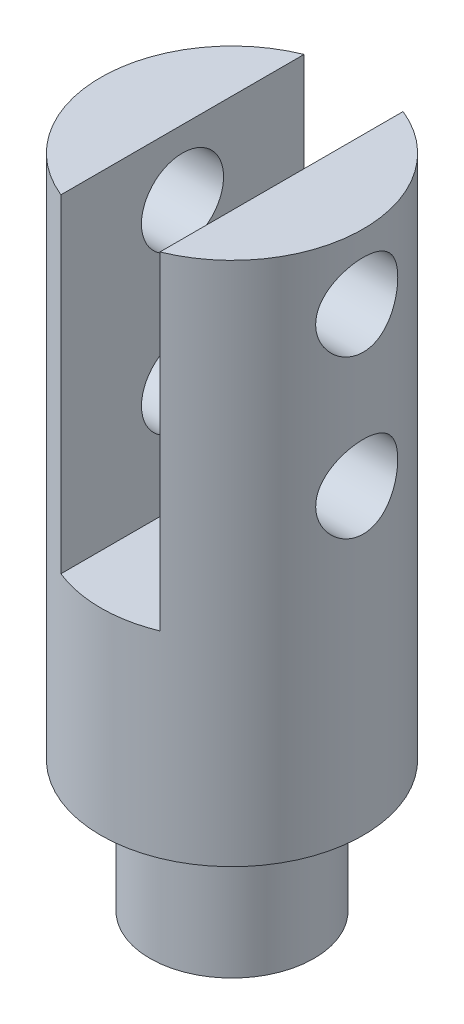
ISO-10303-21;
HEADER;
FILE_DESCRIPTION(('STEP AP214'),'2;1');
FILE_NAME('part.step','',(''),(''),'','','');
FILE_SCHEMA(('AUTOMOTIVE_DESIGN { 1 0 10303 214 1 1 1 1 }'));
ENDSEC;
DATA;
#1=APPLICATION_CONTEXT('core data for automotive mechanical design processes');
#2=APPLICATION_PROTOCOL_DEFINITION('international standard','automotive_design',2000,#1);
#3=PRODUCT_CONTEXT('',#1,'mechanical');
#4=PRODUCT('Part','Part','',(#3));
#5=PRODUCT_RELATED_PRODUCT_CATEGORY('part','',(#4));
#6=PRODUCT_DEFINITION_FORMATION('','',#4);
#7=PRODUCT_DEFINITION_CONTEXT('part definition',#1,'design');
#8=PRODUCT_DEFINITION('design','',#6,#7);
#9=PRODUCT_DEFINITION_SHAPE('','',#8);
#10=(LENGTH_UNIT() NAMED_UNIT(*) SI_UNIT(.MILLI.,.METRE.));
#11=(NAMED_UNIT(*) PLANE_ANGLE_UNIT() SI_UNIT($,.RADIAN.));
#12=(NAMED_UNIT(*) SI_UNIT($,.STERADIAN.) SOLID_ANGLE_UNIT());
#13=UNCERTAINTY_MEASURE_WITH_UNIT(LENGTH_MEASURE(1.E-05),#10,'distance_accuracy_value','');
#14=(GEOMETRIC_REPRESENTATION_CONTEXT(3) GLOBAL_UNCERTAINTY_ASSIGNED_CONTEXT((#13)) GLOBAL_UNIT_ASSIGNED_CONTEXT((#10,
#11,#12)) REPRESENTATION_CONTEXT('',''));
#15=CARTESIAN_POINT('',(0.,0.,0.));
#16=DIRECTION('',(0.,0.,1.));
#17=DIRECTION('',(1.,0.,0.));
#18=AXIS2_PLACEMENT_3D('',#15,#16,#17);
#19=CARTESIAN_POINT('',(0.,0.,0.));
#20=DIRECTION('',(0.,1.,0.));
#21=DIRECTION('',(0.,0.,1.));
#22=AXIS2_PLACEMENT_3D('',#19,#20,#21);
#23=PLANE('',#22);
#24=DIRECTION('',(0.,0.,-1.));
#25=VECTOR('',#24,1.);
#26=CARTESIAN_POINT('',(4.7879,0.,26.2227099301437));
#27=LINE('',#26,#25);
#28=CARTESIAN_POINT('',(4.7879,0.,11.7629083814336));
#29=VERTEX_POINT('',#28);
#30=CARTESIAN_POINT('',(4.7879,0.,-11.7629083814336));
#31=VERTEX_POINT('',#30);
#32=EDGE_CURVE('E77',#29,#31,#27,.T.);
#33=ORIENTED_EDGE('',*,*,#32,.F.);
#34=CARTESIAN_POINT('',(0.,0.,0.));
#35=DIRECTION('',(0.,1.,0.));
#36=DIRECTION('',(0.,0.,1.));
#37=AXIS2_PLACEMENT_3D('',#34,#35,#36);
#38=CIRCLE('',#37,12.7);
#39=EDGE_CURVE('E84',#29,#31,#38,.T.);
#40=ORIENTED_EDGE('',*,*,#39,.T.);
#41=EDGE_LOOP('',(#33,#40));
#42=FACE_BOUND('',#41,.T.);
#43=ADVANCED_FACE('F34',(#42),#23,.T.);
#44=DIRECTION('',(0.,0.,1.));
#45=VECTOR('',#44,1.);
#46=CARTESIAN_POINT('',(-4.7879,0.,26.2227099301437));
#47=LINE('',#46,#45);
#48=CARTESIAN_POINT('',(-4.7879,0.,-11.7629083814336));
#49=VERTEX_POINT('',#48);
#50=CARTESIAN_POINT('',(-4.7879,0.,11.7629083814336));
#51=VERTEX_POINT('',#50);
#52=EDGE_CURVE('E85',#49,#51,#47,.T.);
#53=ORIENTED_EDGE('',*,*,#52,.F.);
#54=EDGE_CURVE('E93',#49,#51,#38,.T.);
#55=ORIENTED_EDGE('',*,*,#54,.T.);
#56=EDGE_LOOP('',(#53,#55));
#57=FACE_BOUND('',#56,.T.);
#58=ADVANCED_FACE('F36',(#57),#23,.T.);
#59=CARTESIAN_POINT('',(0.,54.1051229508197,0.));
#60=DIRECTION('',(0.,1.,0.));
#61=DIRECTION('',(0.,0.,1.));
#62=AXIS2_PLACEMENT_3D('',#59,#60,#61);
#63=CYLINDRICAL_SURFACE('',#62,12.7);
#64=CARTESIAN_POINT('',(-12.7,-2.37744,0.));
#65=CARTESIAN_POINT('',(-12.6999989364852,-2.37744138791249,-0.217492557763878));
#66=CARTESIAN_POINT('',(-12.6943603110892,-2.39536000112773,-0.43499970457634));
#67=CARTESIAN_POINT('',(-12.6724191916379,-2.46637270695974,-0.863652552627288));
#68=CARTESIAN_POINT('',(-12.6561143024,-2.51947470027949,-1.07479681389357));
#69=CARTESIAN_POINT('',(-12.6146217111831,-2.6588878067983,-1.48448068440005));
#70=CARTESIAN_POINT('',(-12.5894477791866,-2.74514745856465,-1.68303927334254));
#71=CARTESIAN_POINT('',(-12.5328159290258,-2.94820815004892,-2.06287399242892));
#72=CARTESIAN_POINT('',(-12.5013570171812,-3.06501402014844,-2.2441473830109));
#73=CARTESIAN_POINT('',(-12.434405504797,-3.32965530098341,-2.58987502339287));
#74=CARTESIAN_POINT('',(-12.3988248999794,-3.47826499988978,-2.75371947787847));
#75=CARTESIAN_POINT('',(-12.3281495374864,-3.80064685931324,-3.05461377606018));
#76=CARTESIAN_POINT('',(-12.2930548716153,-3.97442370525733,-3.19165861921905));
#77=CARTESIAN_POINT('',(-12.2263802746652,-4.34748898232327,-3.43837247280718));
#78=CARTESIAN_POINT('',(-12.1949089417569,-4.54730273264139,-3.54727926216575));
#79=CARTESIAN_POINT('',(-12.1403681406173,-4.96355279542945,-3.72969053094531));
#80=CARTESIAN_POINT('',(-12.1172964547123,-5.17998470207569,-3.80320435646769));
#81=CARTESIAN_POINT('',(-12.0830878271828,-5.61644554014773,-3.91051080755888));
#82=CARTESIAN_POINT('',(-12.0716118578883,-5.83616901477066,-3.94543476323751));
#83=CARTESIAN_POINT('',(-12.0608874846081,-6.27863327561589,-3.97810456397336));
#84=CARTESIAN_POINT('',(-12.0616358227427,-6.50137324210696,-3.97586031466403));
#85=CARTESIAN_POINT('',(-12.0749762843099,-6.93418525877417,-3.93514217597677));
#86=CARTESIAN_POINT('',(-12.087098059951,-7.1444095994836,-3.89810699023441));
#87=CARTESIAN_POINT('',(-12.1210554098322,-7.55549695839661,-3.79119112966301));
#88=CARTESIAN_POINT('',(-12.142892018231,-7.75635897745129,-3.72130695796479));
#89=CARTESIAN_POINT('',(-12.1941787219778,-8.14644504195209,-3.54966190182948));
#90=CARTESIAN_POINT('',(-12.2237355296374,-8.33545582985697,-3.44744961529387));
#91=CARTESIAN_POINT('',(-12.2870834938587,-8.69411470789891,-3.21436326003549));
#92=CARTESIAN_POINT('',(-12.3208757511563,-8.86375774263885,-3.08348173393025));
#93=CARTESIAN_POINT('',(-12.3907734671559,-9.1869984375376,-2.78971448911799));
#94=CARTESIAN_POINT('',(-12.4269141304001,-9.33951122177774,-2.62564123753074));
#95=CARTESIAN_POINT('',(-12.496077188252,-9.61512130845667,-2.27379788611728));
#96=CARTESIAN_POINT('',(-12.5290993508445,-9.73821642327437,-2.08602602554894));
#97=CARTESIAN_POINT('',(-12.5886526113865,-9.95223396566114,-1.69002189927923));
#98=CARTESIAN_POINT('',(-12.615130911478,-10.0428971859756,-1.48164107002917));
#99=CARTESIAN_POINT('',(-12.6582318933316,-10.187560916962,-1.05156492180258));
#100=CARTESIAN_POINT('',(-12.6748575734968,-10.241572582362,-0.829873676166752));
#101=CARTESIAN_POINT('',(-12.6958973744177,-10.3095509256056,-0.388678056186915));
#102=CARTESIAN_POINT('',(-12.7007591131408,-10.3249862243419,-0.169420979767007));
#103=CARTESIAN_POINT('',(-12.699047355392,-10.3195150470694,0.268574231623304));
#104=CARTESIAN_POINT('',(-12.6924755329623,-10.2986138912544,0.487312437868517));
#105=CARTESIAN_POINT('',(-12.6689292134884,-10.2222418730986,0.912393047829627));
#106=CARTESIAN_POINT('',(-12.6522179733833,-10.1676452722643,1.11890850891783));
#107=CARTESIAN_POINT('',(-12.6103486256779,-10.0264993070627,1.51978981464501));
#108=CARTESIAN_POINT('',(-12.5851894743012,-9.93994599417147,1.71415415443784));
#109=CARTESIAN_POINT('',(-12.5282468497323,-9.73498197711441,2.09049282048022));
#110=CARTESIAN_POINT('',(-12.4963166747063,-9.61584524162483,2.27204892256562));
#111=CARTESIAN_POINT('',(-12.4294826490376,-9.34996705404039,2.61308445363422));
#112=CARTESIAN_POINT('',(-12.3945779918333,-9.20321810149365,2.77255786369947));
#113=CARTESIAN_POINT('',(-12.3239844248312,-8.87937364357529,3.07147417537215));
#114=CARTESIAN_POINT('',(-12.2883194045385,-8.70130456189332,3.20987033295593));
#115=CARTESIAN_POINT('',(-12.2216926111029,-8.32369495443146,3.45491105869465));
#116=CARTESIAN_POINT('',(-12.1907307645994,-8.12415476364334,3.56155612213168));
#117=CARTESIAN_POINT('',(-12.1373588401913,-7.70967306391737,3.7394065462174));
#118=CARTESIAN_POINT('',(-12.1149159152886,-7.49479458581322,3.81074835817004));
#119=CARTESIAN_POINT('',(-12.0813163108925,-7.05522861295752,3.9159809635055));
#120=CARTESIAN_POINT('',(-12.070155326175,-6.83054489408704,3.9498860433205));
#121=CARTESIAN_POINT('',(-12.0608324695137,-6.38869066565558,3.97825560084036));
#122=CARTESIAN_POINT('',(-12.062104519437,-6.1716410092991,3.97443753066441));
#123=CARTESIAN_POINT('',(-12.0761289096867,-5.74143784306023,3.93161628411661));
#124=CARTESIAN_POINT('',(-12.0888807125414,-5.52828415124905,3.89261475500183));
#125=CARTESIAN_POINT('',(-12.1240318794813,-5.11500121092369,3.78168430417645));
#126=CARTESIAN_POINT('',(-12.1462866983272,-4.91472658333173,3.71024774286122));
#127=CARTESIAN_POINT('',(-12.1978991973409,-4.52884612131617,3.53686292923591));
#128=CARTESIAN_POINT('',(-12.2272583240984,-4.34324328460893,3.43490846182106));
#129=CARTESIAN_POINT('',(-12.2912067958949,-3.98410156989901,3.19870947726234));
#130=CARTESIAN_POINT('',(-12.3259560124056,-3.81132045239107,3.06335617834633));
#131=CARTESIAN_POINT('',(-12.3960349657771,-3.49036779598578,2.76615169588709));
#132=CARTESIAN_POINT('',(-12.43136485575,-3.34220286611897,2.60429341929131));
#133=CARTESIAN_POINT('',(-12.5000119585414,-3.06983228211151,2.25229799874578));
#134=CARTESIAN_POINT('',(-12.5332254124341,-2.94656982318234,2.06140852836853));
#135=CARTESIAN_POINT('',(-12.5925940830216,-2.73404722162869,1.6605794856469));
#136=CARTESIAN_POINT('',(-12.6187520601081,-2.64477377546746,1.45064740663411));
#137=CARTESIAN_POINT('',(-12.6592504823893,-2.50920890104685,1.03589988887822));
#138=CARTESIAN_POINT('',(-12.674398700637,-2.45993813677705,0.832134597580989));
#139=CARTESIAN_POINT('',(-12.6947729630997,-2.39405633740357,0.41891660491495));
#140=CARTESIAN_POINT('',(-12.7000010242612,-2.37743866331433,0.209465068448066));
#141=CARTESIAN_POINT('',(-12.7,-2.37744,0.));
#142=B_SPLINE_CURVE_WITH_KNOTS('',3,(#64,#65,#66,#67,#68,#69,#70,#71,#72,#73,#74,#75,#76,#77,
#78,#79,#80,#81,#82,#83,#84,#85,#86,#87,#88,#89,#90,#91,#92,#93,#94,#95,#96,#97,#98,#99,#100,
#101,#102,#103,#104,#105,#106,#107,#108,#109,#110,#111,#112,#113,#114,#115,#116,#117,#118,#119,
#120,#121,#122,#123,#124,#125,#126,#127,#128,#129,#130,#131,#132,#133,#134,#135,#136,#137,#138,
#139,#140,#141),.UNSPECIFIED.,.T.,.F.,(4,2,2,2,2,2,2,2,2,2,2,2,2,2,2,2,2,2,2,2,2,2,2,2,2,2,2,2,
2,2,2,2,2,2,2,2,2,2,4),(0.,0.651707735300668,1.30356186628947,1.9544083633484,2.60535784336777,
3.2744551875713,3.94367725971725,4.6294766958225,5.31509493570358,5.98003087291569,
6.64478960206365,7.28321492869985,7.92170823294808,8.56954277091646,9.21754602277983,
9.89510763680892,10.5727196214891,11.2556323060653,11.9383370560521,12.594625460782,
13.2508177832876,13.8906613923976,14.5305840861059,15.1861264828991,15.8418472058662,
16.5236038200059,17.2053497989362,17.8844397552653,18.5632704707704,19.2113432651236,
19.8593857188815,20.4979038526516,21.1365521120022,21.8002269495809,22.4640796856973,
23.1496659626656,23.8349836198352,24.4627649579607,25.0904186431553),.UNSPECIFIED.);
#143=CARTESIAN_POINT('',(-12.7,-2.37744,0.));
#144=VERTEX_POINT('',#143);
#145=EDGE_CURVE('E86',#144,#144,#142,.T.);
#146=ORIENTED_EDGE('',*,*,#145,.F.);
#147=EDGE_LOOP('',(#146));
#148=FACE_BOUND('',#147,.T.);
#149=CARTESIAN_POINT('',(12.0627014821059,-6.35,-3.97256));
#150=CARTESIAN_POINT('',(12.0627027961794,-6.1328014116811,-3.97255856310129));
#151=CARTESIAN_POINT('',(12.0686319145908,-5.91558819013561,-3.9546866204507));
#152=CARTESIAN_POINT('',(12.0916026560791,-5.48754390676897,-3.88387609666546));
#153=CARTESIAN_POINT('',(12.1086472651352,-5.27671457579608,-3.83092809290926));
#154=CARTESIAN_POINT('',(12.151733687867,-4.86770022532404,-3.69196471501516));
#155=CARTESIAN_POINT('',(12.177759548921,-4.66949351983241,-3.60600794117009));
#156=CARTESIAN_POINT('',(12.2358538393342,-4.29025909529024,-3.40366261620942));
#157=CARTESIAN_POINT('',(12.2679233397837,-4.10923442990888,-3.28726866941442));
#158=CARTESIAN_POINT('',(12.3357294758176,-3.76327207579501,-3.0230627709514));
#159=CARTESIAN_POINT('',(12.3715493244807,-3.59901278367133,-2.87438364518377));
#160=CARTESIAN_POINT('',(12.4421121709539,-3.29730488218388,-2.55168336334861));
#161=CARTESIAN_POINT('',(12.4768550175283,-3.15986002396383,-2.37765866755945));
#162=CARTESIAN_POINT('',(12.5423012936835,-2.9126877385371,-2.00433093566138));
#163=CARTESIAN_POINT('',(12.5728953234145,-2.80365912650236,-1.80454436598342));
#164=CARTESIAN_POINT('',(12.6256249951138,-2.62101558695137,-1.38834990171707));
#165=CARTESIAN_POINT('',(12.6477626289638,-2.5473923187407,-1.17194593575396));
#166=CARTESIAN_POINT('',(12.6804961935347,-2.43991497719421,-0.735762867909985));
#167=CARTESIAN_POINT('',(12.6914279026824,-2.40490137292181,-0.516295138671484));
#168=CARTESIAN_POINT('',(12.7017039066272,-2.37196320664494,-0.0743459833627602));
#169=CARTESIAN_POINT('',(12.7010508403752,-2.37403019787731,0.148134744824027));
#170=CARTESIAN_POINT('',(12.6884645894265,-2.41443214938406,0.581632908143987));
#171=CARTESIAN_POINT('',(12.6769223774942,-2.45151008863624,0.792780663294784));
#172=CARTESIAN_POINT('',(12.6443357310436,-2.55881865657165,1.20569070482151));
#173=CARTESIAN_POINT('',(12.6232906764193,-2.62905144878121,1.40745237776282));
#174=CARTESIAN_POINT('',(12.5735385181353,-2.80148270802431,1.79876115661538));
#175=CARTESIAN_POINT('',(12.5447406908756,-2.90406230656547,1.98812830542386));
#176=CARTESIAN_POINT('',(12.4825166385278,-3.137969442559,2.34735212904115));
#177=CARTESIAN_POINT('',(12.4490892421003,-3.26930426034461,2.51720384623838));
#178=CARTESIAN_POINT('',(12.3795164475622,-3.56344567216257,2.8400704159051));
#179=CARTESIAN_POINT('',(12.3433158389733,-3.72733730226057,2.99208624562731));
#180=CARTESIAN_POINT('',(12.2734806830765,-4.07862522252041,3.26677379487549));
#181=CARTESIAN_POINT('',(12.239846439547,-4.26602428831702,3.38944204421229));
#182=CARTESIAN_POINT('',(12.1786733891543,-4.66183500541037,3.60311772524955));
#183=CARTESIAN_POINT('',(12.1512072163646,-4.87045884890678,3.69375443428513));
#184=CARTESIAN_POINT('',(12.1063320884953,-5.30107422021659,3.83829620438531));
#185=CARTESIAN_POINT('',(12.0889195120697,-5.52306090282515,3.89221449283095));
#186=CARTESIAN_POINT('',(12.0669271388999,-5.96452772533215,3.95986001038957));
#187=CARTESIAN_POINT('',(12.061859113871,-6.18374923098028,3.97511732261505));
#188=CARTESIAN_POINT('',(12.0637740199026,-6.62163542974182,3.96930373197379));
#189=CARTESIAN_POINT('',(12.0707550844942,-6.84030020384132,3.9482384556727));
#190=CARTESIAN_POINT('',(12.0954994954556,-7.26427318135323,3.87174517337134));
#191=CARTESIAN_POINT('',(12.1129443996281,-7.46978482128579,3.81733103647696));
#192=CARTESIAN_POINT('',(12.1563133173933,-7.86873785457212,3.67687538646103));
#193=CARTESIAN_POINT('',(12.1822387155875,-8.06217727076107,3.59082870844302));
#194=CARTESIAN_POINT('',(12.2405718748575,-8.43764368473302,3.38673027946662));
#195=CARTESIAN_POINT('',(12.2731444369954,-8.61918330808252,3.26783025311601));
#196=CARTESIAN_POINT('',(12.3407609000887,-8.96029082174931,3.00239016107204));
#197=CARTESIAN_POINT('',(12.3758054427688,-9.11985297475027,2.85584290151663));
#198=CARTESIAN_POINT('',(12.4461785640103,-9.41931305155079,2.53202783311835));
#199=CARTESIAN_POINT('',(12.4814584813061,-9.55811893459465,2.35373685340041));
#200=CARTESIAN_POINT('',(12.5468728034526,-9.8038851711639,1.97553942683843));
#201=CARTESIAN_POINT('',(12.5770074433862,-9.91084697978206,1.77563396822211));
#202=CARTESIAN_POINT('',(12.628564136677,-10.088863319273,1.36111026800587));
#203=CARTESIAN_POINT('',(12.6500489695962,-10.1601775265454,1.14661175504248));
#204=CARTESIAN_POINT('',(12.682161350964,-10.2654817662206,0.707874785633673));
#205=CARTESIAN_POINT('',(12.6927923041024,-10.2994835032037,0.483639406512681));
#206=CARTESIAN_POINT('',(12.7017730874969,-10.328245358304,0.0418454583490813));
#207=CARTESIAN_POINT('',(12.7006165610339,-10.3245827474622,-0.175601606140479));
#208=CARTESIAN_POINT('',(12.6873351980789,-10.2819352178962,-0.606642268059739));
#209=CARTESIAN_POINT('',(12.6752110790507,-10.2429526096893,-0.820236116621895));
#210=CARTESIAN_POINT('',(12.6415133332292,-10.1317765691931,-1.2348723203477));
#211=CARTESIAN_POINT('',(12.6200602203846,-10.0600061183378,-1.43603856480608));
#212=CARTESIAN_POINT('',(12.5699169003506,-9.88567391483367,-1.82357071830948));
#213=CARTESIAN_POINT('',(12.5412254508483,-9.78310687600334,-2.00993407951481));
#214=CARTESIAN_POINT('',(12.4783861846941,-9.54606433729466,-2.36945773200867));
#215=CARTESIAN_POINT('',(12.4440861461251,-9.4106234222484,-2.54195462168637));
#216=CARTESIAN_POINT('',(12.3743360478658,-9.11337966785593,-2.8622955421123));
#217=CARTESIAN_POINT('',(12.3388856463222,-8.95156893365666,-3.01013216292368));
#218=CARTESIAN_POINT('',(12.2694505882544,-8.59973731966918,-3.28191133410888));
#219=CARTESIAN_POINT('',(12.2355537207499,-8.4089579821783,-3.40489719600126));
#220=CARTESIAN_POINT('',(12.1745663544634,-8.00841930528113,-3.61692863151599));
#221=CARTESIAN_POINT('',(12.1474731173528,-7.79866764824759,-3.70598786742965));
#222=CARTESIAN_POINT('',(12.1053693118272,-7.38440106970992,-3.84117521600551));
#223=CARTESIAN_POINT('',(12.0895300101337,-7.18094616382303,-3.89029956312878));
#224=CARTESIAN_POINT('',(12.0681967431713,-6.76833107883764,-3.95598861642747));
#225=CARTESIAN_POINT('',(12.0627002165921,-6.55917232527348,-3.97256138380017));
#226=CARTESIAN_POINT('',(12.0627014821059,-6.35,-3.97256));
#227=B_SPLINE_CURVE_WITH_KNOTS('',3,(#149,#150,#151,#152,#153,#154,#155,#156,#157,#158,#159,
#160,#161,#162,#163,#164,#165,#166,#167,#168,#169,#170,#171,#172,#173,#174,#175,#176,#177,#178,
#179,#180,#181,#182,#183,#184,#185,#186,#187,#188,#189,#190,#191,#192,#193,#194,#195,#196,#197,
#198,#199,#200,#201,#202,#203,#204,#205,#206,#207,#208,#209,#210,#211,#212,#213,#214,#215,#216,
#217,#218,#219,#220,#221,#222,#223,#224,#225,#226),.UNSPECIFIED.,.T.,.F.,(4,2,2,2,2,2,2,2,2,2,2,
2,2,2,2,2,2,2,2,2,2,2,2,2,2,2,2,2,2,2,2,2,2,2,2,2,2,2,4),(0.,0.650823065553643,1.30182103522614,
1.95166859496758,2.60163143311805,3.2718794320224,3.94222112660542,4.62775599462304,
5.31312928699614,5.9773058803367,6.64133117969034,7.28238713481386,7.92348492795103,
8.57243810432638,9.22155577501555,9.89777455807484,10.5740732607921,11.2579609346512,
11.9416021154774,12.5977316209682,13.253759497576,13.8907693124233,14.5278831831561,
15.1832964780732,15.8388805485644,16.5216946490341,17.2044775439993,17.8822114305849,
18.5597326574265,19.2090008617428,19.8582265961503,20.4993036791531,21.1404908649057,
21.8034551456627,22.4666182769928,23.1518073531519,23.8367202104603,24.4636483153288,
25.090421145747),.UNSPECIFIED.);
#228=CARTESIAN_POINT('',(12.0627014821059,-6.35,-3.97256));
#229=VERTEX_POINT('',#228);
#230=EDGE_CURVE('E194',#229,#229,#227,.T.);
#231=ORIENTED_EDGE('',*,*,#230,.F.);
#232=EDGE_LOOP('',(#231));
#233=FACE_BOUND('',#232,.T.);
#234=CARTESIAN_POINT('',(-12.7,-17.62125,0.));
#235=CARTESIAN_POINT('',(-12.6999989166262,-17.6212514179156,-0.217294412929185));
#236=CARTESIAN_POINT('',(-12.6943705657687,-17.6391545455486,-0.434603691696578));
#237=CARTESIAN_POINT('',(-12.6724693873196,-17.7101063168871,-0.862867240443323));
#238=CARTESIAN_POINT('',(-12.6561941503455,-17.7631629158318,-1.07382006065476));
#239=CARTESIAN_POINT('',(-12.6147771484086,-17.9024577535465,-1.48313312609131));
#240=CARTESIAN_POINT('',(-12.589649112594,-17.9886446317732,-1.68151231192993));
#241=CARTESIAN_POINT('',(-12.5331210208647,-18.1915349836287,-2.06100299745001));
#242=CARTESIAN_POINT('',(-12.5017199768221,-18.3082432659034,-2.24211177003752));
#243=CARTESIAN_POINT('',(-12.4348942862538,-18.5726577746551,-2.58751493847349));
#244=CARTESIAN_POINT('',(-12.3993819806814,-18.7211363100689,-2.75120108939738));
#245=CARTESIAN_POINT('',(-12.3288439723815,-19.043232145913,-3.05180168796747));
#246=CARTESIAN_POINT('',(-12.2938183613714,-19.2168541160451,-3.18871115145341));
#247=CARTESIAN_POINT('',(-12.2272788441653,-19.5895739900908,-3.4351701833388));
#248=CARTESIAN_POINT('',(-12.1958731285757,-19.7891954911493,-3.5439598967664));
#249=CARTESIAN_POINT('',(-12.141447707132,-20.2050406000671,-3.72617177918452));
#250=CARTESIAN_POINT('',(-12.1184257926095,-20.4212598171443,-3.79960326475997));
#251=CARTESIAN_POINT('',(-12.0842915217349,-20.8572991459117,-3.90678860277786));
#252=CARTESIAN_POINT('',(-12.0728413904273,-21.0768147285585,-3.94167074274712));
#253=CARTESIAN_POINT('',(-12.0621442508097,-21.5188581525402,-3.97429212242695));
#254=CARTESIAN_POINT('',(-12.062893998283,-21.7413851773397,-3.97204123662538));
#255=CARTESIAN_POINT('',(-12.0762137528427,-22.1738014113807,-3.93134293525445));
#256=CARTESIAN_POINT('',(-12.0883153493259,-22.383842474694,-3.89432983731616));
#257=CARTESIAN_POINT('',(-12.1222143133603,-22.7945700970855,-3.78748332400532));
#258=CARTESIAN_POINT('',(-12.144012711345,-22.9952556594939,-3.71764642055649));
#259=CARTESIAN_POINT('',(-12.1952081477563,-23.384992423548,-3.5461217711417));
#260=CARTESIAN_POINT('',(-12.2247115380623,-23.5738308389402,-3.44398363977409));
#261=CARTESIAN_POINT('',(-12.287943946336,-23.9321586630231,-3.21106865842369));
#262=CARTESIAN_POINT('',(-12.3216740610048,-24.1016430280574,-3.08028436905926));
#263=CARTESIAN_POINT('',(-12.3914385076889,-24.424560445347,-2.7867513295291));
#264=CARTESIAN_POINT('',(-12.427507834987,-24.57691159595,-2.62281851163243));
#265=CARTESIAN_POINT('',(-12.4965323716104,-24.852223262116,-2.27128199570308));
#266=CARTESIAN_POINT('',(-12.5294873501166,-24.9751816002711,-2.08367654558308));
#267=CARTESIAN_POINT('',(-12.5889161127652,-25.1889504113089,-1.68803513822788));
#268=CARTESIAN_POINT('',(-12.615337375581,-25.2795028300981,-1.47985132946873));
#269=CARTESIAN_POINT('',(-12.6583425975561,-25.4239807777038,-1.05018832945988));
#270=CARTESIAN_POINT('',(-12.6749295435735,-25.4779174281069,-0.828713197550627));
#271=CARTESIAN_POINT('',(-12.6959166132918,-25.5457897851883,-0.387937874396849));
#272=CARTESIAN_POINT('',(-12.7007627269301,-25.5611901259094,-0.168884119904577));
#273=CARTESIAN_POINT('',(-12.6990411414587,-25.5556822304265,0.268701220700962));
#274=CARTESIAN_POINT('',(-12.692475109701,-25.5347792982507,0.487232878423167));
#275=CARTESIAN_POINT('',(-12.6689600496899,-25.4584339934747,0.911921382198321));
#276=CARTESIAN_POINT('',(-12.6522731812643,-25.4038631253304,1.11825080648648));
#277=CARTESIAN_POINT('',(-12.6104688537924,-25.2627944312357,1.51876737413487));
#278=CARTESIAN_POINT('',(-12.5853503535804,-25.1762926622206,1.71295301442576));
#279=CARTESIAN_POINT('',(-12.5285037326117,-24.9714600374579,2.0889353911842));
#280=CARTESIAN_POINT('',(-12.4966294014609,-24.8524046146976,2.27031467382624));
#281=CARTESIAN_POINT('',(-12.4299157676089,-24.5867135578772,2.61101157679883));
#282=CARTESIAN_POINT('',(-12.3950756621704,-24.4400704436608,2.77032319328954));
#283=CARTESIAN_POINT('',(-12.3246195875397,-24.1164780240846,3.06891519476789));
#284=CARTESIAN_POINT('',(-12.2890275779295,-23.938558092628,3.20715171178012));
#285=CARTESIAN_POINT('',(-12.2225418202855,-23.5612729930037,3.45189969528356));
#286=CARTESIAN_POINT('',(-12.1916479976341,-23.3619081655143,3.55841166565639));
#287=CARTESIAN_POINT('',(-12.1383990890051,-22.9478040761362,3.73602515050722));
#288=CARTESIAN_POINT('',(-12.1160110218308,-22.7331281130416,3.8072637709034));
#289=CARTESIAN_POINT('',(-12.0824996743068,-22.2939848339356,3.91232689459936));
#290=CARTESIAN_POINT('',(-12.071372107564,-22.0695212776093,3.94616563489433));
#291=CARTESIAN_POINT('',(-12.0620882936656,-21.6280870219321,3.97444614552049));
#292=CARTESIAN_POINT('',(-12.0633681960545,-21.4112365340344,3.97060037798693));
#293=CARTESIAN_POINT('',(-12.0773853694349,-20.9814331928093,3.92775497559047));
#294=CARTESIAN_POINT('',(-12.0901221059534,-20.7684801581346,3.88875698061476));
#295=CARTESIAN_POINT('',(-12.1252238503226,-20.3555789242957,3.77786042475736));
#296=CARTESIAN_POINT('',(-12.1474451675406,-20.1554859745286,3.70645189639076));
#297=CARTESIAN_POINT('',(-12.1989756100824,-19.7699616870295,3.53314721788623));
#298=CARTESIAN_POINT('',(-12.2282861769408,-19.5845333414011,3.43124486610452));
#299=CARTESIAN_POINT('',(-12.2921232133137,-19.2257490438536,3.19518268167841));
#300=CARTESIAN_POINT('',(-12.3268088783039,-19.0531491888367,3.0599168393912));
#301=CARTESIAN_POINT('',(-12.3967557125734,-18.7325434082444,2.76291356358524));
#302=CARTESIAN_POINT('',(-12.4320170335113,-18.5845440824534,2.60116904944344));
#303=CARTESIAN_POINT('',(-12.500523384491,-18.3125029406977,2.24944515446412));
#304=CARTESIAN_POINT('',(-12.5336649799489,-18.1894012117714,2.05871627399745));
#305=CARTESIAN_POINT('',(-12.5928999251759,-17.9771709444322,1.65823626319334));
#306=CARTESIAN_POINT('',(-12.6189960445273,-17.8880290506997,1.44849265100055));
#307=CARTESIAN_POINT('',(-12.6593806607877,-17.7527224078431,1.03424874231238));
#308=CARTESIAN_POINT('',(-12.674480645595,-17.7035622963056,0.830803320332334));
#309=CARTESIAN_POINT('',(-12.6947898358103,-17.6378287071025,0.418242418022786));
#310=CARTESIAN_POINT('',(-12.7000010426587,-17.6212486353723,0.209128093743467));
#311=CARTESIAN_POINT('',(-12.7,-17.62125,0.));
#312=B_SPLINE_CURVE_WITH_KNOTS('',3,(#234,#235,#236,#237,#238,#239,#240,#241,#242,#243,#244,
#245,#246,#247,#248,#249,#250,#251,#252,#253,#254,#255,#256,#257,#258,#259,#260,#261,#262,#263,
#264,#265,#266,#267,#268,#269,#270,#271,#272,#273,#274,#275,#276,#277,#278,#279,#280,#281,#282,
#283,#284,#285,#286,#287,#288,#289,#290,#291,#292,#293,#294,#295,#296,#297,#298,#299,#300,#301,
#302,#303,#304,#305,#306,#307,#308,#309,#310,#311),.UNSPECIFIED.,.T.,.F.,(4,2,2,2,2,2,2,2,2,2,2,
2,2,2,2,2,2,2,2,2,2,2,2,2,2,2,2,2,2,2,2,2,2,2,2,2,2,2,4),(0.,0.651114551948219,1.30237650163329,
1.95263287146774,2.60299175094789,3.27145085469628,3.94003426594302,4.62514223710794,
5.31006958937499,5.97437051780892,6.63849479687064,7.27636712817898,7.91430725938283,
8.56156665642489,9.20899434587646,9.88589422617488,10.56284423542,11.2450708769478,
11.9270902077497,12.5827653014541,13.2383446069148,13.8776273984988,14.5169891598929,
15.17193831049,15.8270653013166,16.5081514741898,17.1892268287804,17.8676336752166,
18.5457821837881,19.1932624606433,19.8407125334477,20.478683750695,21.1167848028337,
21.7798495700527,22.4430919369543,23.1279912133643,23.8126208620069,24.4393922140371,
25.0660366970775),.UNSPECIFIED.);
#313=CARTESIAN_POINT('',(-12.7,-17.62125,0.));
#314=VERTEX_POINT('',#313);
#315=EDGE_CURVE('E116',#314,#314,#312,.T.);
#316=ORIENTED_EDGE('',*,*,#315,.F.);
#317=EDGE_LOOP('',(#316));
#318=FACE_BOUND('',#317,.T.);
#319=CARTESIAN_POINT('',(12.0639555468967,-21.59,-3.96875));
#320=CARTESIAN_POINT('',(12.0639568842915,-21.3729981603529,-3.9687485325165));
#321=CARTESIAN_POINT('',(12.0698746252851,-21.1559814093673,-3.95089185662995));
#322=CARTESIAN_POINT('',(12.0928015382143,-20.728323539213,-3.88014131899213));
#323=CARTESIAN_POINT('',(12.1098137074621,-20.5176841590754,-3.82723798884485));
#324=CARTESIAN_POINT('',(12.1528185580417,-20.1090374363659,-3.68839077609799));
#325=CARTESIAN_POINT('',(12.1787953399195,-19.9110084598895,-3.60250535963949));
#326=CARTESIAN_POINT('',(12.2367803974433,-19.5321151906318,-3.40032702499773));
#327=CARTESIAN_POINT('',(12.2687897383379,-19.3512539378766,-3.28402873500381));
#328=CARTESIAN_POINT('',(12.3364665534787,-19.0056170957082,-3.02004752422578));
#329=CARTESIAN_POINT('',(12.3722169174668,-18.8415180400407,-2.87149984411226));
#330=CARTESIAN_POINT('',(12.4426423060656,-18.5401076580608,-2.54908699749619));
#331=CARTESIAN_POINT('',(12.4773171799559,-18.4028000722001,-2.37521830174644));
#332=CARTESIAN_POINT('',(12.542632820135,-18.1558848749393,-2.00223727216643));
#333=CARTESIAN_POINT('',(12.5731646098682,-18.0469739903351,-1.8026429419513));
#334=CARTESIAN_POINT('',(12.6257860206983,-17.8645310417086,-1.38685343930956));
#335=CARTESIAN_POINT('',(12.6478776258324,-17.7909906620751,-1.17066218269639));
#336=CARTESIAN_POINT('',(12.6805428323124,-17.6836351682918,-0.73489933336736));
#337=CARTESIAN_POINT('',(12.6914509627465,-17.6486637444236,-0.515638146611585));
#338=CARTESIAN_POINT('',(12.7017016690635,-17.6157752000609,-0.0741070844008488));
#339=CARTESIAN_POINT('',(12.7010468740197,-17.6178496564107,0.14816209563955));
#340=CARTESIAN_POINT('',(12.6884784372079,-17.6582333257854,0.581261475126273));
#341=CARTESIAN_POINT('',(12.6769542933653,-17.6952890426538,0.792221663947055));
#342=CARTESIAN_POINT('',(12.6444210713078,-17.8025265933866,1.2047634761292));
#343=CARTESIAN_POINT('',(12.6234113745139,-17.87271058765,1.40634448690292));
#344=CARTESIAN_POINT('',(12.5737448464102,-18.0450178503125,1.7972979775163));
#345=CARTESIAN_POINT('',(12.5449975673293,-18.1475215171867,1.986490837852));
#346=CARTESIAN_POINT('',(12.4828847037847,-18.3812532415629,2.34538047290818));
#347=CARTESIAN_POINT('',(12.4495179522495,-18.5124885627659,2.51507230096488));
#348=CARTESIAN_POINT('',(12.3800765457896,-18.8063937904907,2.83761719258918));
#349=CARTESIAN_POINT('',(12.3439469905188,-18.9701457935578,2.98947379336682));
#350=CARTESIAN_POINT('',(12.2742520403678,-19.3211294483057,3.26386743274752));
#351=CARTESIAN_POINT('',(12.2406869478284,-19.5083638616244,3.38640101789399));
#352=CARTESIAN_POINT('',(12.1796443805944,-19.903812963591,3.59982976435593));
#353=CARTESIAN_POINT('',(12.1522391668376,-20.1122388235463,3.6903558622175));
#354=CARTESIAN_POINT('',(12.1074670626035,-20.5424388865984,3.83471248377108));
#355=CARTESIAN_POINT('',(12.090096565806,-20.7642082625671,3.8885561917888));
#356=CARTESIAN_POINT('',(12.0681611381735,-21.2052533494324,3.95609715466836));
#357=CARTESIAN_POINT('',(12.0631098080017,-21.4242713380466,3.97132030073623));
#358=CARTESIAN_POINT('',(12.0650342093526,-21.8617474292471,3.96547163781533));
#359=CARTESIAN_POINT('',(12.0720080824823,-22.0802056131214,3.94440543703716));
#360=CARTESIAN_POINT('',(12.0967169001143,-22.5037913418714,3.86793973404382));
#361=CARTESIAN_POINT('',(12.1141348427388,-22.7091216951856,3.81355063934748));
#362=CARTESIAN_POINT('',(12.1574333727713,-23.1077191895868,3.67316936373721));
#363=CARTESIAN_POINT('',(12.1833153403409,-23.3009843571746,3.58717202843405));
#364=CARTESIAN_POINT('',(12.2415471339902,-23.6760991735255,3.38320096332414));
#365=CARTESIAN_POINT('',(12.2740611607997,-23.8574624945071,3.26438093276173));
#366=CARTESIAN_POINT('',(12.3415535798866,-24.198231849699,2.99912534755837));
#367=CARTESIAN_POINT('',(12.3765326108584,-24.3576321613379,2.85268261914323));
#368=CARTESIAN_POINT('',(12.4467679551152,-24.6567654117732,2.5291191091177));
#369=CARTESIAN_POINT('',(12.4819756800704,-24.7954094709941,2.35097843807855));
#370=CARTESIAN_POINT('',(12.5472526500367,-25.040879062545,1.97310865744318));
#371=CARTESIAN_POINT('',(12.5773221303875,-25.1477060523125,1.77338053726987));
#372=CARTESIAN_POINT('',(12.6287629037303,-25.3254845358476,1.35923503657856));
#373=CARTESIAN_POINT('',(12.6501969360681,-25.3966957389037,1.14493733510092));
#374=CARTESIAN_POINT('',(12.6822277040923,-25.5018303100223,0.706619281629033));
#375=CARTESIAN_POINT('',(12.6928278310283,-25.5357653465901,0.482601994980629));
#376=CARTESIAN_POINT('',(12.7017717580916,-25.564436430555,0.041227173860252));
#377=CARTESIAN_POINT('',(12.7006073586846,-25.5607453292922,-0.176019434430209));
#378=CARTESIAN_POINT('',(12.6873310540733,-25.5180724999204,-0.606657479606313));
#379=CARTESIAN_POINT('',(12.6752198626356,-25.4790930727256,-0.820049166920131));
#380=CARTESIAN_POINT('',(12.6415663743223,-25.3679515207193,-1.23429750117651));
#381=CARTESIAN_POINT('',(12.6201439227365,-25.2962104950909,-1.4352775410771));
#382=CARTESIAN_POINT('',(12.5700772724174,-25.1219626236131,-1.82244500096279));
#383=CARTESIAN_POINT('',(12.5414318351506,-25.0194505008344,-2.00862987679648));
#384=CARTESIAN_POINT('',(12.4786992260472,-24.7825489922564,-2.36779338152876));
#385=CARTESIAN_POINT('',(12.444460434593,-24.6471963161769,-2.54010987739363));
#386=CARTESIAN_POINT('',(12.3748398853692,-24.350154851017,-2.86010601269284));
#387=CARTESIAN_POINT('',(12.3394577881682,-24.1884581821074,-3.00777825387571));
#388=CARTESIAN_POINT('',(12.2701650893336,-23.8368975895045,-3.27923099268227));
#389=CARTESIAN_POINT('',(12.2363420774147,-23.6462779451049,-3.40205783883207));
#390=CARTESIAN_POINT('',(12.1754939776251,-23.2460859681455,-3.61379994626556));
#391=CARTESIAN_POINT('',(12.148466141849,-23.0365213435205,-3.70272892306258));
#392=CARTESIAN_POINT('',(12.1064832939804,-22.6227556900259,-3.83765997883641));
#393=CARTESIAN_POINT('',(12.090695752639,-22.4196194118413,-3.88667433985248));
#394=CARTESIAN_POINT('',(12.0694325058161,-22.0076590830936,-3.95221605466116));
#395=CARTESIAN_POINT('',(12.0639542598257,-21.7988364466852,-3.96875141226471));
#396=CARTESIAN_POINT('',(12.0639555468967,-21.59,-3.96875));
#397=B_SPLINE_CURVE_WITH_KNOTS('',3,(#319,#320,#321,#322,#323,#324,#325,#326,#327,#328,#329,
#330,#331,#332,#333,#334,#335,#336,#337,#338,#339,#340,#341,#342,#343,#344,#345,#346,#347,#348,
#349,#350,#351,#352,#353,#354,#355,#356,#357,#358,#359,#360,#361,#362,#363,#364,#365,#366,#367,
#368,#369,#370,#371,#372,#373,#374,#375,#376,#377,#378,#379,#380,#381,#382,#383,#384,#385,#386,
#387,#388,#389,#390,#391,#392,#393,#394,#395,#396),.UNSPECIFIED.,.T.,.F.,(4,2,2,2,2,2,2,2,2,2,2,
2,2,2,2,2,2,2,2,2,2,2,2,2,2,2,2,2,2,2,2,2,2,2,2,2,2,2,4),(0.,0.65023408671646,1.30064391591466,
1.9499060700765,2.59928298063672,3.26888730748912,3.93858505338065,4.62342934734853,
5.30811255551902,5.97165820002819,6.63505297547884,7.27554370928958,7.91607621728546,
8.56444834631699,9.21298458114371,9.88854826126036,10.5641914653574,11.2473889522044,
11.9303407555771,12.5858566319692,13.2412712130333,13.8777336124857,14.5142998466166,
15.1691217226574,15.8241138944544,16.5062515255927,17.1883579053947,17.8654150975664,
18.5422602910408,19.1909319775321,19.839561371558,20.4800786269208,21.1207057872722,
21.7830620061678,22.4456167093443,23.1301225072563,23.8143510505986,24.4402722513687,
25.066039186821),.UNSPECIFIED.);
#398=CARTESIAN_POINT('',(12.0639555468967,-21.59,-3.96875));
#399=VERTEX_POINT('',#398);
#400=EDGE_CURVE('E111',#399,#399,#397,.T.);
#401=ORIENTED_EDGE('',*,*,#400,.F.);
#402=EDGE_LOOP('',(#401));
#403=FACE_BOUND('',#402,.T.);
#404=DIRECTION('',(0.,1.,0.));
#405=VECTOR('',#404,1.);
#406=CARTESIAN_POINT('',(4.7879,54.1051229508197,11.7629083814336));
#407=LINE('',#406,#405);
#408=CARTESIAN_POINT('',(4.7879,-31.75,11.7629083814336));
#409=VERTEX_POINT('',#408);
#410=EDGE_CURVE('E11',#409,#29,#407,.T.);
#411=ORIENTED_EDGE('',*,*,#410,.F.);
#412=CARTESIAN_POINT('',(0.,-31.75,0.));
#413=DIRECTION('',(0.,-1.,0.));
#414=DIRECTION('',(0.,0.,-1.));
#415=AXIS2_PLACEMENT_3D('',#412,#413,#414);
#416=CIRCLE('',#415,12.7);
#417=CARTESIAN_POINT('',(-4.7879,-31.75,11.7629083814336));
#418=VERTEX_POINT('',#417);
#419=EDGE_CURVE('E97',#418,#409,#416,.F.);
#420=ORIENTED_EDGE('',*,*,#419,.F.);
#421=DIRECTION('',(0.,1.,0.));
#422=VECTOR('',#421,1.);
#423=CARTESIAN_POINT('',(-4.7879,54.1051229508197,11.7629083814336));
#424=LINE('',#423,#422);
#425=EDGE_CURVE('E43',#51,#418,#424,.F.);
#426=ORIENTED_EDGE('',*,*,#425,.F.);
#427=ORIENTED_EDGE('',*,*,#54,.F.);
#428=DIRECTION('',(0.,1.,0.));
#429=VECTOR('',#428,1.);
#430=CARTESIAN_POINT('',(-4.7879,54.1051229508197,-11.7629083814336));
#431=LINE('',#430,#429);
#432=CARTESIAN_POINT('',(-4.7879,-31.75,-11.7629083814336));
#433=VERTEX_POINT('',#432);
#434=EDGE_CURVE('E95',#433,#49,#431,.T.);
#435=ORIENTED_EDGE('',*,*,#434,.F.);
#436=CARTESIAN_POINT('',(4.7879,-31.75,-11.7629083814336));
#437=VERTEX_POINT('',#436);
#438=EDGE_CURVE('E92',#437,#433,#416,.F.);
#439=ORIENTED_EDGE('',*,*,#438,.F.);
#440=DIRECTION('',(0.,1.,0.));
#441=VECTOR('',#440,1.);
#442=CARTESIAN_POINT('',(4.7879,54.1051229508197,-11.7629083814336));
#443=LINE('',#442,#441);
#444=EDGE_CURVE('E91',#31,#437,#443,.F.);
#445=ORIENTED_EDGE('',*,*,#444,.F.);
#446=ORIENTED_EDGE('',*,*,#39,.F.);
#447=EDGE_LOOP('',(#411,#420,#426,#427,#435,#439,#445,#446));
#448=FACE_BOUND('',#447,.T.);
#449=CARTESIAN_POINT('',(0.,-50.8,0.));
#450=DIRECTION('',(0.,1.,0.));
#451=DIRECTION('',(0.,0.,1.));
#452=AXIS2_PLACEMENT_3D('',#449,#450,#451);
#453=CIRCLE('',#452,12.7);
#454=CARTESIAN_POINT('',(0.,-50.8,12.7));
#455=VERTEX_POINT('',#454);
#456=EDGE_CURVE('E99',#455,#455,#453,.T.);
#457=ORIENTED_EDGE('',*,*,#456,.T.);
#458=EDGE_LOOP('',(#457));
#459=FACE_BOUND('',#458,.T.);
#460=ADVANCED_FACE('F88',(#148,#233,#318,#403,#448,#459),#63,.T.);
#461=CARTESIAN_POINT('',(0.,-50.8,12.7));
#462=DIRECTION('',(0.,-1.,0.));
#463=DIRECTION('',(0.,0.,-1.));
#464=AXIS2_PLACEMENT_3D('',#461,#462,#463);
#465=PLANE('',#464);
#466=CARTESIAN_POINT('',(0.,-50.8,0.));
#467=DIRECTION('',(0.,1.,0.));
#468=DIRECTION('',(0.,0.,1.));
#469=AXIS2_PLACEMENT_3D('',#466,#467,#468);
#470=CIRCLE('',#469,7.9375);
#471=CARTESIAN_POINT('',(0.,-50.8,7.9375));
#472=VERTEX_POINT('',#471);
#473=EDGE_CURVE('E181',#472,#472,#470,.T.);
#474=ORIENTED_EDGE('',*,*,#473,.T.);
#475=EDGE_LOOP('',(#474));
#476=FACE_BOUND('',#475,.T.);
#477=ORIENTED_EDGE('',*,*,#456,.F.);
#478=EDGE_LOOP('',(#477));
#479=FACE_BOUND('',#478,.T.);
#480=ADVANCED_FACE('F156',(#476,#479),#465,.T.);
#481=CARTESIAN_POINT('',(0.,54.1051229508197,0.));
#482=DIRECTION('',(0.,1.,0.));
#483=DIRECTION('',(0.,0.,1.));
#484=AXIS2_PLACEMENT_3D('',#481,#482,#483);
#485=CYLINDRICAL_SURFACE('',#484,7.9375);
#486=CARTESIAN_POINT('',(0.,-63.5,0.));
#487=DIRECTION('',(0.,1.,0.));
#488=DIRECTION('',(0.,0.,1.));
#489=AXIS2_PLACEMENT_3D('',#486,#487,#488);
#490=CIRCLE('',#489,7.9375);
#491=CARTESIAN_POINT('',(0.,-63.5,7.9375));
#492=VERTEX_POINT('',#491);
#493=EDGE_CURVE('E178',#492,#492,#490,.T.);
#494=ORIENTED_EDGE('',*,*,#493,.T.);
#495=EDGE_LOOP('',(#494));
#496=FACE_BOUND('',#495,.T.);
#497=ORIENTED_EDGE('',*,*,#473,.F.);
#498=EDGE_LOOP('',(#497));
#499=FACE_BOUND('',#498,.T.);
#500=ADVANCED_FACE('F153',(#496,#499),#485,.T.);
#501=CARTESIAN_POINT('',(0.,-63.5,7.9375));
#502=DIRECTION('',(0.,-1.,0.));
#503=DIRECTION('',(0.,0.,-1.));
#504=AXIS2_PLACEMENT_3D('',#501,#502,#503);
#505=PLANE('',#504);
#506=ORIENTED_EDGE('',*,*,#493,.F.);
#507=EDGE_LOOP('',(#506));
#508=FACE_BOUND('',#507,.T.);
#509=ADVANCED_FACE('F149',(#508),#505,.T.);
#510=CARTESIAN_POINT('',(4.7879,-31.75,26.2227099301437));
#511=DIRECTION('',(1.,0.,0.));
#512=DIRECTION('',(0.,0.,-1.));
#513=AXIS2_PLACEMENT_3D('',#510,#511,#512);
#514=PLANE('',#513);
#515=CARTESIAN_POINT('',(4.7879,-6.35,0.));
#516=DIRECTION('',(1.,0.,0.));
#517=DIRECTION('',(0.,0.,-1.));
#518=AXIS2_PLACEMENT_3D('',#515,#516,#517);
#519=CIRCLE('',#518,3.97256);
#520=CARTESIAN_POINT('',(4.7879,-6.35,-3.97256));
#521=VERTEX_POINT('',#520);
#522=EDGE_CURVE('E199',#521,#521,#519,.T.);
#523=ORIENTED_EDGE('',*,*,#522,.T.);
#524=EDGE_LOOP('',(#523));
#525=FACE_BOUND('',#524,.T.);
#526=CARTESIAN_POINT('',(4.7879,-21.59,0.));
#527=DIRECTION('',(1.,0.,0.));
#528=DIRECTION('',(0.,0.,-1.));
#529=AXIS2_PLACEMENT_3D('',#526,#527,#528);
#530=CIRCLE('',#529,3.96875);
#531=CARTESIAN_POINT('',(4.7879,-21.59,-3.96875));
#532=VERTEX_POINT('',#531);
#533=EDGE_CURVE('E107',#532,#532,#530,.T.);
#534=ORIENTED_EDGE('',*,*,#533,.T.);
#535=EDGE_LOOP('',(#534));
#536=FACE_BOUND('',#535,.T.);
#537=ORIENTED_EDGE('',*,*,#444,.T.);
#538=DIRECTION('',(0.,0.,-1.));
#539=VECTOR('',#538,1.);
#540=CARTESIAN_POINT('',(4.7879,-31.75,26.2227099301437));
#541=LINE('',#540,#539);
#542=EDGE_CURVE('E51',#409,#437,#541,.T.);
#543=ORIENTED_EDGE('',*,*,#542,.F.);
#544=ORIENTED_EDGE('',*,*,#410,.T.);
#545=ORIENTED_EDGE('',*,*,#32,.T.);
#546=EDGE_LOOP('',(#537,#543,#544,#545));
#547=FACE_BOUND('',#546,.T.);
#548=ADVANCED_FACE('F76',(#525,#536,#547),#514,.F.);
#549=CARTESIAN_POINT('',(-4.7879,-31.75,26.2227099301437));
#550=DIRECTION('',(-1.,0.,0.));
#551=DIRECTION('',(0.,0.,1.));
#552=AXIS2_PLACEMENT_3D('',#549,#550,#551);
#553=PLANE('',#552);
#554=CARTESIAN_POINT('',(-4.7879,-6.35,0.));
#555=DIRECTION('',(-1.,0.,0.));
#556=DIRECTION('',(0.,0.,1.));
#557=AXIS2_PLACEMENT_3D('',#554,#555,#556);
#558=CIRCLE('',#557,3.97256);
#559=CARTESIAN_POINT('',(-4.7879,-6.35,3.97256));
#560=VERTEX_POINT('',#559);
#561=EDGE_CURVE('E38',#560,#560,#558,.T.);
#562=ORIENTED_EDGE('',*,*,#561,.T.);
#563=EDGE_LOOP('',(#562));
#564=FACE_BOUND('',#563,.T.);
#565=CARTESIAN_POINT('',(-4.7879,-21.59,0.));
#566=DIRECTION('',(-1.,0.,0.));
#567=DIRECTION('',(0.,0.,1.));
#568=AXIS2_PLACEMENT_3D('',#565,#566,#567);
#569=CIRCLE('',#568,3.96875);
#570=CARTESIAN_POINT('',(-4.7879,-21.59,3.96875));
#571=VERTEX_POINT('',#570);
#572=EDGE_CURVE('E105',#571,#571,#569,.T.);
#573=ORIENTED_EDGE('',*,*,#572,.T.);
#574=EDGE_LOOP('',(#573));
#575=FACE_BOUND('',#574,.T.);
#576=ORIENTED_EDGE('',*,*,#425,.T.);
#577=DIRECTION('',(0.,0.,1.));
#578=VECTOR('',#577,1.);
#579=CARTESIAN_POINT('',(-4.7879,-31.75,26.2227099301437));
#580=LINE('',#579,#578);
#581=EDGE_CURVE('E177',#433,#418,#580,.T.);
#582=ORIENTED_EDGE('',*,*,#581,.F.);
#583=ORIENTED_EDGE('',*,*,#434,.T.);
#584=ORIENTED_EDGE('',*,*,#52,.T.);
#585=EDGE_LOOP('',(#576,#582,#583,#584));
#586=FACE_BOUND('',#585,.T.);
#587=ADVANCED_FACE('F143',(#564,#575,#586),#553,.F.);
#588=CARTESIAN_POINT('',(0.,-31.75,0.));
#589=DIRECTION('',(0.,-1.,0.));
#590=DIRECTION('',(0.,0.,-1.));
#591=AXIS2_PLACEMENT_3D('',#588,#589,#590);
#592=PLANE('',#591);
#593=ORIENTED_EDGE('',*,*,#419,.T.);
#594=ORIENTED_EDGE('',*,*,#542,.T.);
#595=ORIENTED_EDGE('',*,*,#438,.T.);
#596=ORIENTED_EDGE('',*,*,#581,.T.);
#597=EDGE_LOOP('',(#593,#594,#595,#596));
#598=FACE_BOUND('',#597,.T.);
#599=ADVANCED_FACE('F139',(#598),#592,.F.);
#600=CARTESIAN_POINT('',(-12.7,-21.59,0.));
#601=DIRECTION('',(1.,0.,0.));
#602=DIRECTION('',(0.,0.,-1.));
#603=AXIS2_PLACEMENT_3D('',#600,#601,#602);
#604=CYLINDRICAL_SURFACE('',#603,3.96875);
#605=ORIENTED_EDGE('',*,*,#315,.T.);
#606=EDGE_LOOP('',(#605));
#607=FACE_BOUND('',#606,.T.);
#608=ORIENTED_EDGE('',*,*,#572,.F.);
#609=EDGE_LOOP('',(#608));
#610=FACE_BOUND('',#609,.T.);
#611=ADVANCED_FACE('F137',(#607,#610),#604,.F.);
#612=CARTESIAN_POINT('',(-12.7,-6.35,0.));
#613=DIRECTION('',(1.,0.,0.));
#614=DIRECTION('',(0.,0.,-1.));
#615=AXIS2_PLACEMENT_3D('',#612,#613,#614);
#616=CYLINDRICAL_SURFACE('',#615,3.97256);
#617=ORIENTED_EDGE('',*,*,#145,.T.);
#618=EDGE_LOOP('',(#617));
#619=FACE_BOUND('',#618,.T.);
#620=ORIENTED_EDGE('',*,*,#561,.F.);
#621=EDGE_LOOP('',(#620));
#622=FACE_BOUND('',#621,.T.);
#623=ADVANCED_FACE('F135',(#619,#622),#616,.F.);
#624=ORIENTED_EDGE('',*,*,#400,.T.);
#625=EDGE_LOOP('',(#624));
#626=FACE_BOUND('',#625,.T.);
#627=ORIENTED_EDGE('',*,*,#533,.F.);
#628=EDGE_LOOP('',(#627));
#629=FACE_BOUND('',#628,.T.);
#630=ADVANCED_FACE('F129',(#626,#629),#604,.F.);
#631=ORIENTED_EDGE('',*,*,#230,.T.);
#632=EDGE_LOOP('',(#631));
#633=FACE_BOUND('',#632,.T.);
#634=ORIENTED_EDGE('',*,*,#522,.F.);
#635=EDGE_LOOP('',(#634));
#636=FACE_BOUND('',#635,.T.);
#637=ADVANCED_FACE('F134',(#633,#636),#616,.F.);
#638=CLOSED_SHELL('',(#43,#58,#460,#480,#500,#509,#548,#587,#599,#611,#623,#630,#637));
#639=MANIFOLD_SOLID_BREP('B2',#638);
#640=ADVANCED_BREP_SHAPE_REPRESENTATION('',(#18,#639),#14);
#641=SHAPE_DEFINITION_REPRESENTATION(#9,#640);
ENDSEC;
END-ISO-10303-21;
